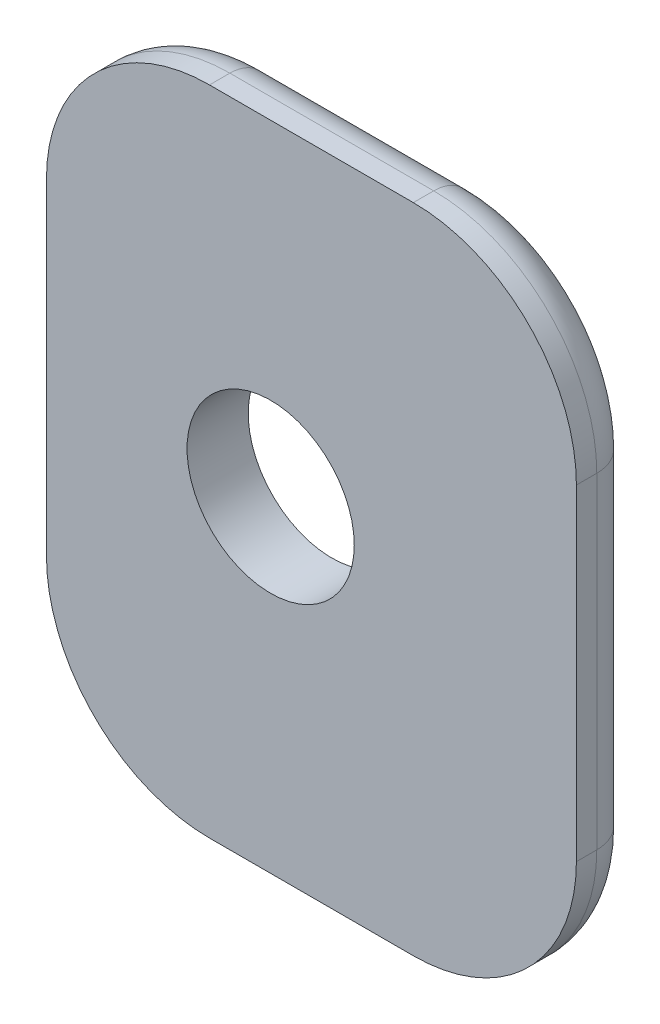
ISO-10303-21;
HEADER;
FILE_DESCRIPTION(('STEP AP214'),'2;1');
FILE_NAME('part.step','',(''),(''),'','','');
FILE_SCHEMA(('AUTOMOTIVE_DESIGN { 1 0 10303 214 1 1 1 1 }'));
ENDSEC;
DATA;
#1=APPLICATION_CONTEXT('core data for automotive mechanical design processes');
#2=APPLICATION_PROTOCOL_DEFINITION('international standard','automotive_design',2000,#1);
#3=PRODUCT_CONTEXT('',#1,'mechanical');
#4=PRODUCT('Part','Part','',(#3));
#5=PRODUCT_RELATED_PRODUCT_CATEGORY('part','',(#4));
#6=PRODUCT_DEFINITION_FORMATION('','',#4);
#7=PRODUCT_DEFINITION_CONTEXT('part definition',#1,'design');
#8=PRODUCT_DEFINITION('design','',#6,#7);
#9=PRODUCT_DEFINITION_SHAPE('','',#8);
#10=(LENGTH_UNIT() NAMED_UNIT(*) SI_UNIT(.MILLI.,.METRE.));
#11=(NAMED_UNIT(*) PLANE_ANGLE_UNIT() SI_UNIT($,.RADIAN.));
#12=(NAMED_UNIT(*) SI_UNIT($,.STERADIAN.) SOLID_ANGLE_UNIT());
#13=UNCERTAINTY_MEASURE_WITH_UNIT(LENGTH_MEASURE(1.E-05),#10,'distance_accuracy_value','');
#14=(GEOMETRIC_REPRESENTATION_CONTEXT(3) GLOBAL_UNCERTAINTY_ASSIGNED_CONTEXT((#13)) GLOBAL_UNIT_ASSIGNED_CONTEXT((#10,
#11,#12)) REPRESENTATION_CONTEXT('',''));
#15=CARTESIAN_POINT('',(0.,0.,0.));
#16=DIRECTION('',(0.,0.,1.));
#17=DIRECTION('',(1.,0.,0.));
#18=AXIS2_PLACEMENT_3D('',#15,#16,#17);
#19=CARTESIAN_POINT('',(15.,-16.,3.));
#20=DIRECTION('',(0.,0.,1.));
#21=DIRECTION('',(1.,0.,0.));
#22=AXIS2_PLACEMENT_3D('',#19,#20,#21);
#23=PLANE('',#22);
#24=DIRECTION('',(1.,0.,0.));
#25=VECTOR('',#24,1.);
#26=CARTESIAN_POINT('',(-11.,-16.,3.));
#27=LINE('',#26,#25);
#28=CARTESIAN_POINT('',(-3.,-16.,3.));
#29=VERTEX_POINT('',#28);
#30=CARTESIAN_POINT('',(6.99999999999999,-16.,3.));
#31=VERTEX_POINT('',#30);
#32=EDGE_CURVE('E129',#29,#31,#27,.T.);
#33=ORIENTED_EDGE('',*,*,#32,.T.);
#34=CARTESIAN_POINT('',(7.,-8.,3.));
#35=DIRECTION('',(0.,0.,1.));
#36=DIRECTION('',(1.,0.,0.));
#37=AXIS2_PLACEMENT_3D('',#34,#35,#36);
#38=CIRCLE('',#37,8.);
#39=CARTESIAN_POINT('',(15.,-8.,3.));
#40=VERTEX_POINT('',#39);
#41=EDGE_CURVE('E123',#31,#40,#38,.T.);
#42=ORIENTED_EDGE('',*,*,#41,.T.);
#43=DIRECTION('',(0.,1.,0.));
#44=VECTOR('',#43,1.);
#45=CARTESIAN_POINT('',(15.,16.,3.));
#46=LINE('',#45,#44);
#47=CARTESIAN_POINT('',(15.,8.00000000000001,3.));
#48=VERTEX_POINT('',#47);
#49=EDGE_CURVE('E126',#40,#48,#46,.T.);
#50=ORIENTED_EDGE('',*,*,#49,.T.);
#51=CARTESIAN_POINT('',(7.,8.00000000000001,3.));
#52=DIRECTION('',(0.,0.,1.));
#53=DIRECTION('',(1.,0.,0.));
#54=AXIS2_PLACEMENT_3D('',#51,#52,#53);
#55=CIRCLE('',#54,8.);
#56=CARTESIAN_POINT('',(6.99999999999999,16.,3.));
#57=VERTEX_POINT('',#56);
#58=EDGE_CURVE('E159',#48,#57,#55,.T.);
#59=ORIENTED_EDGE('',*,*,#58,.T.);
#60=DIRECTION('',(-1.,0.,0.));
#61=VECTOR('',#60,1.);
#62=CARTESIAN_POINT('',(-11.,16.,3.));
#63=LINE('',#62,#61);
#64=CARTESIAN_POINT('',(-3.00000000000001,16.,3.));
#65=VERTEX_POINT('',#64);
#66=EDGE_CURVE('E143',#57,#65,#63,.T.);
#67=ORIENTED_EDGE('',*,*,#66,.T.);
#68=CARTESIAN_POINT('',(-3.,8.,3.));
#69=DIRECTION('',(0.,0.,1.));
#70=DIRECTION('',(1.,0.,0.));
#71=AXIS2_PLACEMENT_3D('',#68,#69,#70);
#72=CIRCLE('',#71,8.);
#73=CARTESIAN_POINT('',(-11.,8.,3.));
#74=VERTEX_POINT('',#73);
#75=EDGE_CURVE('E157',#65,#74,#72,.T.);
#76=ORIENTED_EDGE('',*,*,#75,.T.);
#77=DIRECTION('',(0.,-1.,0.));
#78=VECTOR('',#77,1.);
#79=CARTESIAN_POINT('',(-11.,16.,3.));
#80=LINE('',#79,#78);
#81=CARTESIAN_POINT('',(-11.,-8.,3.));
#82=VERTEX_POINT('',#81);
#83=EDGE_CURVE('E235',#74,#82,#80,.T.);
#84=ORIENTED_EDGE('',*,*,#83,.T.);
#85=CARTESIAN_POINT('',(-3.,-8.,3.));
#86=DIRECTION('',(0.,0.,1.));
#87=DIRECTION('',(1.,0.,0.));
#88=AXIS2_PLACEMENT_3D('',#85,#86,#87);
#89=CIRCLE('',#88,8.);
#90=EDGE_CURVE('E134',#82,#29,#89,.T.);
#91=ORIENTED_EDGE('',*,*,#90,.T.);
#92=EDGE_LOOP('',(#33,#42,#50,#59,#67,#76,#84,#91));
#93=FACE_BOUND('',#92,.T.);
#94=CARTESIAN_POINT('',(0.,0.,3.));
#95=DIRECTION('',(0.,0.,1.));
#96=DIRECTION('',(1.,0.,0.));
#97=AXIS2_PLACEMENT_3D('',#94,#95,#96);
#98=CIRCLE('',#97,4.1021);
#99=CARTESIAN_POINT('',(4.1021,0.,3.));
#100=VERTEX_POINT('',#99);
#101=EDGE_CURVE('E144',#100,#100,#98,.T.);
#102=ORIENTED_EDGE('',*,*,#101,.F.);
#103=EDGE_LOOP('',(#102));
#104=FACE_BOUND('',#103,.T.);
#105=ADVANCED_FACE('F32',(#93,#104),#23,.T.);
#106=CARTESIAN_POINT('',(15.,-16.,0.));
#107=DIRECTION('',(0.,0.,1.));
#108=DIRECTION('',(1.,0.,0.));
#109=AXIS2_PLACEMENT_3D('',#106,#107,#108);
#110=PLANE('',#109);
#111=DIRECTION('',(0.,-1.,0.));
#112=VECTOR('',#111,1.);
#113=CARTESIAN_POINT('',(-9.,-16.,0.));
#114=LINE('',#113,#112);
#115=CARTESIAN_POINT('',(-9.,-8.,0.));
#116=VERTEX_POINT('',#115);
#117=CARTESIAN_POINT('',(-9.,8.,0.));
#118=VERTEX_POINT('',#117);
#119=EDGE_CURVE('E170',#116,#118,#114,.F.);
#120=ORIENTED_EDGE('',*,*,#119,.T.);
#121=CARTESIAN_POINT('',(-3.,8.,0.));
#122=DIRECTION('',(0.,0.,1.));
#123=DIRECTION('',(1.,0.,0.));
#124=AXIS2_PLACEMENT_3D('',#121,#122,#123);
#125=CIRCLE('',#124,6.);
#126=CARTESIAN_POINT('',(-3.,14.,0.));
#127=VERTEX_POINT('',#126);
#128=EDGE_CURVE('E184',#118,#127,#125,.F.);
#129=ORIENTED_EDGE('',*,*,#128,.T.);
#130=DIRECTION('',(-1.,0.,0.));
#131=VECTOR('',#130,1.);
#132=CARTESIAN_POINT('',(15.,14.,0.));
#133=LINE('',#132,#131);
#134=CARTESIAN_POINT('',(6.99999999999999,14.,0.));
#135=VERTEX_POINT('',#134);
#136=EDGE_CURVE('E182',#127,#135,#133,.F.);
#137=ORIENTED_EDGE('',*,*,#136,.T.);
#138=CARTESIAN_POINT('',(7.,8.00000000000001,0.));
#139=DIRECTION('',(0.,0.,1.));
#140=DIRECTION('',(1.,0.,0.));
#141=AXIS2_PLACEMENT_3D('',#138,#139,#140);
#142=CIRCLE('',#141,6.);
#143=CARTESIAN_POINT('',(13.,8.00000000000001,0.));
#144=VERTEX_POINT('',#143);
#145=EDGE_CURVE('E180',#135,#144,#142,.F.);
#146=ORIENTED_EDGE('',*,*,#145,.T.);
#147=DIRECTION('',(0.,1.,0.));
#148=VECTOR('',#147,1.);
#149=CARTESIAN_POINT('',(13.,-16.,0.));
#150=LINE('',#149,#148);
#151=CARTESIAN_POINT('',(13.,-8.,0.));
#152=VERTEX_POINT('',#151);
#153=EDGE_CURVE('E178',#144,#152,#150,.F.);
#154=ORIENTED_EDGE('',*,*,#153,.T.);
#155=CARTESIAN_POINT('',(7.,-8.,0.));
#156=DIRECTION('',(0.,0.,1.));
#157=DIRECTION('',(1.,0.,0.));
#158=AXIS2_PLACEMENT_3D('',#155,#156,#157);
#159=CIRCLE('',#158,6.);
#160=CARTESIAN_POINT('',(7.,-14.,0.));
#161=VERTEX_POINT('',#160);
#162=EDGE_CURVE('E176',#152,#161,#159,.F.);
#163=ORIENTED_EDGE('',*,*,#162,.T.);
#164=DIRECTION('',(1.,0.,0.));
#165=VECTOR('',#164,1.);
#166=CARTESIAN_POINT('',(15.,-14.,0.));
#167=LINE('',#166,#165);
#168=CARTESIAN_POINT('',(-3.,-14.,0.));
#169=VERTEX_POINT('',#168);
#170=EDGE_CURVE('E174',#161,#169,#167,.F.);
#171=ORIENTED_EDGE('',*,*,#170,.T.);
#172=CARTESIAN_POINT('',(-3.,-8.,0.));
#173=DIRECTION('',(0.,0.,1.));
#174=DIRECTION('',(1.,0.,0.));
#175=AXIS2_PLACEMENT_3D('',#172,#173,#174);
#176=CIRCLE('',#175,6.);
#177=EDGE_CURVE('E172',#169,#116,#176,.F.);
#178=ORIENTED_EDGE('',*,*,#177,.T.);
#179=EDGE_LOOP('',(#120,#129,#137,#146,#154,#163,#171,#178));
#180=FACE_BOUND('',#179,.T.);
#181=CARTESIAN_POINT('',(0.,0.,0.));
#182=DIRECTION('',(0.,0.,1.));
#183=DIRECTION('',(1.,0.,0.));
#184=AXIS2_PLACEMENT_3D('',#181,#182,#183);
#185=CIRCLE('',#184,4.1021);
#186=CARTESIAN_POINT('',(4.1021,0.,0.));
#187=VERTEX_POINT('',#186);
#188=EDGE_CURVE('E221',#187,#187,#185,.T.);
#189=ORIENTED_EDGE('',*,*,#188,.T.);
#190=EDGE_LOOP('',(#189));
#191=FACE_BOUND('',#190,.T.);
#192=ADVANCED_FACE('F252',(#180,#191),#110,.F.);
#193=CARTESIAN_POINT('',(15.,16.,3.));
#194=DIRECTION('',(-1.,0.,0.));
#195=DIRECTION('',(0.,-1.,0.));
#196=AXIS2_PLACEMENT_3D('',#193,#194,#195);
#197=PLANE('',#196);
#198=DIRECTION('',(0.,0.,-1.));
#199=VECTOR('',#198,1.);
#200=CARTESIAN_POINT('',(15.,-8.,3.));
#201=LINE('',#200,#199);
#202=CARTESIAN_POINT('',(15.,-8.,2.));
#203=VERTEX_POINT('',#202);
#204=EDGE_CURVE('E139',#40,#203,#201,.T.);
#205=ORIENTED_EDGE('',*,*,#204,.T.);
#206=DIRECTION('',(0.,1.,0.));
#207=VECTOR('',#206,1.);
#208=CARTESIAN_POINT('',(15.,16.,2.));
#209=LINE('',#208,#207);
#210=CARTESIAN_POINT('',(15.,8.00000000000001,2.));
#211=VERTEX_POINT('',#210);
#212=EDGE_CURVE('E194',#203,#211,#209,.T.);
#213=ORIENTED_EDGE('',*,*,#212,.T.);
#214=DIRECTION('',(0.,0.,-1.));
#215=VECTOR('',#214,1.);
#216=CARTESIAN_POINT('',(15.,8.00000000000001,3.));
#217=LINE('',#216,#215);
#218=EDGE_CURVE('E142',#211,#48,#217,.F.);
#219=ORIENTED_EDGE('',*,*,#218,.T.);
#220=ORIENTED_EDGE('',*,*,#49,.F.);
#221=EDGE_LOOP('',(#205,#213,#219,#220));
#222=FACE_BOUND('',#221,.T.);
#223=ADVANCED_FACE('F138',(#222),#197,.F.);
#224=CARTESIAN_POINT('',(-11.,16.,3.));
#225=DIRECTION('',(0.,-1.,0.));
#226=DIRECTION('',(1.,0.,0.));
#227=AXIS2_PLACEMENT_3D('',#224,#225,#226);
#228=PLANE('',#227);
#229=DIRECTION('',(0.,0.,-1.));
#230=VECTOR('',#229,1.);
#231=CARTESIAN_POINT('',(6.99999999999999,16.,3.));
#232=LINE('',#231,#230);
#233=CARTESIAN_POINT('',(6.99999999999999,16.,2.));
#234=VERTEX_POINT('',#233);
#235=EDGE_CURVE('E167',#57,#234,#232,.T.);
#236=ORIENTED_EDGE('',*,*,#235,.T.);
#237=DIRECTION('',(-1.,0.,0.));
#238=VECTOR('',#237,1.);
#239=CARTESIAN_POINT('',(-11.,16.,2.));
#240=LINE('',#239,#238);
#241=CARTESIAN_POINT('',(-3.,16.,2.));
#242=VERTEX_POINT('',#241);
#243=EDGE_CURVE('E190',#234,#242,#240,.T.);
#244=ORIENTED_EDGE('',*,*,#243,.T.);
#245=DIRECTION('',(0.,0.,-1.));
#246=VECTOR('',#245,1.);
#247=CARTESIAN_POINT('',(-3.,16.,3.));
#248=LINE('',#247,#246);
#249=EDGE_CURVE('E165',#242,#65,#248,.F.);
#250=ORIENTED_EDGE('',*,*,#249,.T.);
#251=ORIENTED_EDGE('',*,*,#66,.F.);
#252=EDGE_LOOP('',(#236,#244,#250,#251));
#253=FACE_BOUND('',#252,.T.);
#254=ADVANCED_FACE('F264',(#253),#228,.F.);
#255=CARTESIAN_POINT('',(-11.,16.,3.));
#256=DIRECTION('',(1.,0.,0.));
#257=DIRECTION('',(0.,1.,0.));
#258=AXIS2_PLACEMENT_3D('',#255,#256,#257);
#259=PLANE('',#258);
#260=DIRECTION('',(0.,0.,-1.));
#261=VECTOR('',#260,1.);
#262=CARTESIAN_POINT('',(-11.,8.,3.));
#263=LINE('',#262,#261);
#264=CARTESIAN_POINT('',(-11.,8.,2.));
#265=VERTEX_POINT('',#264);
#266=EDGE_CURVE('E133',#74,#265,#263,.T.);
#267=ORIENTED_EDGE('',*,*,#266,.T.);
#268=DIRECTION('',(0.,-1.,0.));
#269=VECTOR('',#268,1.);
#270=CARTESIAN_POINT('',(-11.,16.,2.));
#271=LINE('',#270,#269);
#272=CARTESIAN_POINT('',(-11.,-8.,2.));
#273=VERTEX_POINT('',#272);
#274=EDGE_CURVE('E11',#265,#273,#271,.T.);
#275=ORIENTED_EDGE('',*,*,#274,.T.);
#276=DIRECTION('',(0.,0.,-1.));
#277=VECTOR('',#276,1.);
#278=CARTESIAN_POINT('',(-11.,-8.,3.));
#279=LINE('',#278,#277);
#280=EDGE_CURVE('E163',#273,#82,#279,.F.);
#281=ORIENTED_EDGE('',*,*,#280,.T.);
#282=ORIENTED_EDGE('',*,*,#83,.F.);
#283=EDGE_LOOP('',(#267,#275,#281,#282));
#284=FACE_BOUND('',#283,.T.);
#285=ADVANCED_FACE('F302',(#284),#259,.F.);
#286=CARTESIAN_POINT('',(-11.,-16.,3.));
#287=DIRECTION('',(0.,1.,0.));
#288=DIRECTION('',(0.,0.,1.));
#289=AXIS2_PLACEMENT_3D('',#286,#287,#288);
#290=PLANE('',#289);
#291=DIRECTION('',(0.,0.,-1.));
#292=VECTOR('',#291,1.);
#293=CARTESIAN_POINT('',(-3.,-16.,3.));
#294=LINE('',#293,#292);
#295=CARTESIAN_POINT('',(-3.,-16.,2.));
#296=VERTEX_POINT('',#295);
#297=EDGE_CURVE('E149',#29,#296,#294,.T.);
#298=ORIENTED_EDGE('',*,*,#297,.T.);
#299=DIRECTION('',(1.,0.,0.));
#300=VECTOR('',#299,1.);
#301=CARTESIAN_POINT('',(-11.,-16.,2.));
#302=LINE('',#301,#300);
#303=CARTESIAN_POINT('',(7.,-16.,2.));
#304=VERTEX_POINT('',#303);
#305=EDGE_CURVE('E197',#296,#304,#302,.T.);
#306=ORIENTED_EDGE('',*,*,#305,.T.);
#307=DIRECTION('',(0.,0.,-1.));
#308=VECTOR('',#307,1.);
#309=CARTESIAN_POINT('',(7.,-16.,3.));
#310=LINE('',#309,#308);
#311=EDGE_CURVE('E151',#304,#31,#310,.F.);
#312=ORIENTED_EDGE('',*,*,#311,.T.);
#313=ORIENTED_EDGE('',*,*,#32,.F.);
#314=EDGE_LOOP('',(#298,#306,#312,#313));
#315=FACE_BOUND('',#314,.T.);
#316=ADVANCED_FACE('F243',(#315),#290,.F.);
#317=CARTESIAN_POINT('',(0.,0.,3.));
#318=DIRECTION('',(0.,0.,-1.));
#319=DIRECTION('',(-1.,0.,0.));
#320=AXIS2_PLACEMENT_3D('',#317,#318,#319);
#321=CYLINDRICAL_SURFACE('',#320,4.1021);
#322=ORIENTED_EDGE('',*,*,#101,.T.);
#323=EDGE_LOOP('',(#322));
#324=FACE_BOUND('',#323,.T.);
#325=ORIENTED_EDGE('',*,*,#188,.F.);
#326=EDGE_LOOP('',(#325));
#327=FACE_BOUND('',#326,.T.);
#328=ADVANCED_FACE('F298',(#324,#327),#321,.F.);
#329=CARTESIAN_POINT('',(7.,-8.,3.));
#330=DIRECTION('',(0.,0.,-1.));
#331=DIRECTION('',(-1.,0.,0.));
#332=AXIS2_PLACEMENT_3D('',#329,#330,#331);
#333=CYLINDRICAL_SURFACE('',#332,8.);
#334=ORIENTED_EDGE('',*,*,#311,.F.);
#335=CARTESIAN_POINT('',(7.,-8.,2.));
#336=DIRECTION('',(0.,0.,1.));
#337=DIRECTION('',(1.,0.,0.));
#338=AXIS2_PLACEMENT_3D('',#335,#336,#337);
#339=CIRCLE('',#338,8.);
#340=EDGE_CURVE('E148',#304,#203,#339,.T.);
#341=ORIENTED_EDGE('',*,*,#340,.T.);
#342=ORIENTED_EDGE('',*,*,#204,.F.);
#343=ORIENTED_EDGE('',*,*,#41,.F.);
#344=EDGE_LOOP('',(#334,#341,#342,#343));
#345=FACE_BOUND('',#344,.T.);
#346=ADVANCED_FACE('F146',(#345),#333,.T.);
#347=CARTESIAN_POINT('',(-3.,-8.,3.));
#348=DIRECTION('',(0.,0.,-1.));
#349=DIRECTION('',(-1.,0.,0.));
#350=AXIS2_PLACEMENT_3D('',#347,#348,#349);
#351=CYLINDRICAL_SURFACE('',#350,8.);
#352=ORIENTED_EDGE('',*,*,#280,.F.);
#353=CARTESIAN_POINT('',(-3.,-8.,2.));
#354=DIRECTION('',(0.,0.,1.));
#355=DIRECTION('',(1.,0.,0.));
#356=AXIS2_PLACEMENT_3D('',#353,#354,#355);
#357=CIRCLE('',#356,8.);
#358=EDGE_CURVE('E41',#273,#296,#357,.T.);
#359=ORIENTED_EDGE('',*,*,#358,.T.);
#360=ORIENTED_EDGE('',*,*,#297,.F.);
#361=ORIENTED_EDGE('',*,*,#90,.F.);
#362=EDGE_LOOP('',(#352,#359,#360,#361));
#363=FACE_BOUND('',#362,.T.);
#364=ADVANCED_FACE('F241',(#363),#351,.T.);
#365=CARTESIAN_POINT('',(7.,8.00000000000001,3.));
#366=DIRECTION('',(0.,0.,-1.));
#367=DIRECTION('',(-1.,0.,0.));
#368=AXIS2_PLACEMENT_3D('',#365,#366,#367);
#369=CYLINDRICAL_SURFACE('',#368,8.);
#370=ORIENTED_EDGE('',*,*,#218,.F.);
#371=CARTESIAN_POINT('',(7.,8.00000000000001,2.));
#372=DIRECTION('',(0.,0.,1.));
#373=DIRECTION('',(1.,0.,0.));
#374=AXIS2_PLACEMENT_3D('',#371,#372,#373);
#375=CIRCLE('',#374,8.);
#376=EDGE_CURVE('E192',#211,#234,#375,.T.);
#377=ORIENTED_EDGE('',*,*,#376,.T.);
#378=ORIENTED_EDGE('',*,*,#235,.F.);
#379=ORIENTED_EDGE('',*,*,#58,.F.);
#380=EDGE_LOOP('',(#370,#377,#378,#379));
#381=FACE_BOUND('',#380,.T.);
#382=ADVANCED_FACE('F260',(#381),#369,.T.);
#383=CARTESIAN_POINT('',(-3.,8.,3.));
#384=DIRECTION('',(0.,0.,-1.));
#385=DIRECTION('',(-1.,0.,0.));
#386=AXIS2_PLACEMENT_3D('',#383,#384,#385);
#387=CYLINDRICAL_SURFACE('',#386,8.);
#388=ORIENTED_EDGE('',*,*,#249,.F.);
#389=CARTESIAN_POINT('',(-3.,8.,2.));
#390=DIRECTION('',(0.,0.,1.));
#391=DIRECTION('',(1.,0.,0.));
#392=AXIS2_PLACEMENT_3D('',#389,#390,#391);
#393=CIRCLE('',#392,8.);
#394=EDGE_CURVE('E187',#242,#265,#393,.T.);
#395=ORIENTED_EDGE('',*,*,#394,.T.);
#396=ORIENTED_EDGE('',*,*,#266,.F.);
#397=ORIENTED_EDGE('',*,*,#75,.F.);
#398=EDGE_LOOP('',(#388,#395,#396,#397));
#399=FACE_BOUND('',#398,.T.);
#400=ADVANCED_FACE('F270',(#399),#387,.T.);
#401=CARTESIAN_POINT('',(7.,-8.,2.));
#402=DIRECTION('',(0.,0.,1.));
#403=DIRECTION('',(1.,0.,0.));
#404=AXIS2_PLACEMENT_3D('',#401,#402,#403);
#405=TOROIDAL_SURFACE('',#404,6.,2.);
#406=CARTESIAN_POINT('',(13.,-8.,2.));
#407=DIRECTION('',(0.,1.,0.));
#408=DIRECTION('',(0.,0.,1.));
#409=AXIS2_PLACEMENT_3D('',#406,#407,#408);
#410=CIRCLE('',#409,2.);
#411=EDGE_CURVE('E215',#203,#152,#410,.T.);
#412=ORIENTED_EDGE('',*,*,#411,.F.);
#413=ORIENTED_EDGE('',*,*,#340,.F.);
#414=CARTESIAN_POINT('',(7.,-14.,2.));
#415=DIRECTION('',(-1.,0.,0.));
#416=DIRECTION('',(0.,0.,1.));
#417=AXIS2_PLACEMENT_3D('',#414,#415,#416);
#418=CIRCLE('',#417,2.);
#419=EDGE_CURVE('E36',#161,#304,#418,.T.);
#420=ORIENTED_EDGE('',*,*,#419,.F.);
#421=ORIENTED_EDGE('',*,*,#162,.F.);
#422=EDGE_LOOP('',(#412,#413,#420,#421));
#423=FACE_BOUND('',#422,.T.);
#424=ADVANCED_FACE('F34',(#423),#405,.T.);
#425=CARTESIAN_POINT('',(-11.,-14.,2.));
#426=DIRECTION('',(1.,0.,0.));
#427=DIRECTION('',(0.,0.,-1.));
#428=AXIS2_PLACEMENT_3D('',#425,#426,#427);
#429=CYLINDRICAL_SURFACE('',#428,2.);
#430=ORIENTED_EDGE('',*,*,#419,.T.);
#431=ORIENTED_EDGE('',*,*,#305,.F.);
#432=CARTESIAN_POINT('',(-3.,-14.,2.));
#433=DIRECTION('',(-1.,0.,0.));
#434=DIRECTION('',(0.,0.,1.));
#435=AXIS2_PLACEMENT_3D('',#432,#433,#434);
#436=CIRCLE('',#435,2.);
#437=EDGE_CURVE('E213',#169,#296,#436,.T.);
#438=ORIENTED_EDGE('',*,*,#437,.F.);
#439=ORIENTED_EDGE('',*,*,#170,.F.);
#440=EDGE_LOOP('',(#430,#431,#438,#439));
#441=FACE_BOUND('',#440,.T.);
#442=ADVANCED_FACE('F245',(#441),#429,.T.);
#443=CARTESIAN_POINT('',(13.,16.,2.));
#444=DIRECTION('',(0.,1.,0.));
#445=DIRECTION('',(-1.,0.,0.));
#446=AXIS2_PLACEMENT_3D('',#443,#444,#445);
#447=CYLINDRICAL_SURFACE('',#446,2.);
#448=ORIENTED_EDGE('',*,*,#411,.T.);
#449=ORIENTED_EDGE('',*,*,#153,.F.);
#450=CARTESIAN_POINT('',(13.,8.00000000000001,2.));
#451=DIRECTION('',(0.,1.,0.));
#452=DIRECTION('',(0.,0.,1.));
#453=AXIS2_PLACEMENT_3D('',#450,#451,#452);
#454=CIRCLE('',#453,2.);
#455=EDGE_CURVE('E210',#211,#144,#454,.T.);
#456=ORIENTED_EDGE('',*,*,#455,.F.);
#457=ORIENTED_EDGE('',*,*,#212,.F.);
#458=EDGE_LOOP('',(#448,#449,#456,#457));
#459=FACE_BOUND('',#458,.T.);
#460=ADVANCED_FACE('F257',(#459),#447,.T.);
#461=CARTESIAN_POINT('',(-3.,-8.,2.));
#462=DIRECTION('',(0.,0.,1.));
#463=DIRECTION('',(1.,0.,0.));
#464=AXIS2_PLACEMENT_3D('',#461,#462,#463);
#465=TOROIDAL_SURFACE('',#464,6.,2.);
#466=ORIENTED_EDGE('',*,*,#437,.T.);
#467=ORIENTED_EDGE('',*,*,#358,.F.);
#468=CARTESIAN_POINT('',(-9.,-8.,2.));
#469=DIRECTION('',(0.,1.,0.));
#470=DIRECTION('',(0.,0.,1.));
#471=AXIS2_PLACEMENT_3D('',#468,#469,#470);
#472=CIRCLE('',#471,2.);
#473=EDGE_CURVE('E207',#116,#273,#472,.T.);
#474=ORIENTED_EDGE('',*,*,#473,.F.);
#475=ORIENTED_EDGE('',*,*,#177,.F.);
#476=EDGE_LOOP('',(#466,#467,#474,#475));
#477=FACE_BOUND('',#476,.T.);
#478=ADVANCED_FACE('F248',(#477),#465,.T.);
#479=CARTESIAN_POINT('',(7.,8.00000000000001,2.));
#480=DIRECTION('',(0.,0.,1.));
#481=DIRECTION('',(1.,0.,0.));
#482=AXIS2_PLACEMENT_3D('',#479,#480,#481);
#483=TOROIDAL_SURFACE('',#482,6.,2.);
#484=ORIENTED_EDGE('',*,*,#455,.T.);
#485=ORIENTED_EDGE('',*,*,#145,.F.);
#486=CARTESIAN_POINT('',(6.99999999999999,14.,2.));
#487=DIRECTION('',(-1.,0.,0.));
#488=DIRECTION('',(0.,-1.,0.));
#489=AXIS2_PLACEMENT_3D('',#486,#487,#488);
#490=CIRCLE('',#489,2.);
#491=EDGE_CURVE('E204',#234,#135,#490,.T.);
#492=ORIENTED_EDGE('',*,*,#491,.F.);
#493=ORIENTED_EDGE('',*,*,#376,.F.);
#494=EDGE_LOOP('',(#484,#485,#492,#493));
#495=FACE_BOUND('',#494,.T.);
#496=ADVANCED_FACE('F280',(#495),#483,.T.);
#497=CARTESIAN_POINT('',(-9.,16.,2.));
#498=DIRECTION('',(0.,-1.,0.));
#499=DIRECTION('',(1.,0.,0.));
#500=AXIS2_PLACEMENT_3D('',#497,#498,#499);
#501=CYLINDRICAL_SURFACE('',#500,2.);
#502=ORIENTED_EDGE('',*,*,#473,.T.);
#503=ORIENTED_EDGE('',*,*,#274,.F.);
#504=CARTESIAN_POINT('',(-9.,8.,2.));
#505=DIRECTION('',(0.,1.,0.));
#506=DIRECTION('',(0.,0.,1.));
#507=AXIS2_PLACEMENT_3D('',#504,#505,#506);
#508=CIRCLE('',#507,2.);
#509=EDGE_CURVE('E202',#118,#265,#508,.T.);
#510=ORIENTED_EDGE('',*,*,#509,.F.);
#511=ORIENTED_EDGE('',*,*,#119,.F.);
#512=EDGE_LOOP('',(#502,#503,#510,#511));
#513=FACE_BOUND('',#512,.T.);
#514=ADVANCED_FACE('F282',(#513),#501,.T.);
#515=CARTESIAN_POINT('',(-11.,14.,2.));
#516=DIRECTION('',(-1.,0.,0.));
#517=DIRECTION('',(0.,-1.,0.));
#518=AXIS2_PLACEMENT_3D('',#515,#516,#517);
#519=CYLINDRICAL_SURFACE('',#518,2.);
#520=ORIENTED_EDGE('',*,*,#491,.T.);
#521=ORIENTED_EDGE('',*,*,#136,.F.);
#522=CARTESIAN_POINT('',(-3.,14.,2.));
#523=DIRECTION('',(-1.,0.,0.));
#524=DIRECTION('',(0.,-1.,0.));
#525=AXIS2_PLACEMENT_3D('',#522,#523,#524);
#526=CIRCLE('',#525,2.);
#527=EDGE_CURVE('E200',#242,#127,#526,.T.);
#528=ORIENTED_EDGE('',*,*,#527,.F.);
#529=ORIENTED_EDGE('',*,*,#243,.F.);
#530=EDGE_LOOP('',(#520,#521,#528,#529));
#531=FACE_BOUND('',#530,.T.);
#532=ADVANCED_FACE('F277',(#531),#519,.T.);
#533=CARTESIAN_POINT('',(-3.,8.,2.));
#534=DIRECTION('',(0.,0.,1.));
#535=DIRECTION('',(1.,0.,0.));
#536=AXIS2_PLACEMENT_3D('',#533,#534,#535);
#537=TOROIDAL_SURFACE('',#536,6.,2.);
#538=ORIENTED_EDGE('',*,*,#509,.T.);
#539=ORIENTED_EDGE('',*,*,#394,.F.);
#540=ORIENTED_EDGE('',*,*,#527,.T.);
#541=ORIENTED_EDGE('',*,*,#128,.F.);
#542=EDGE_LOOP('',(#538,#539,#540,#541));
#543=FACE_BOUND('',#542,.T.);
#544=ADVANCED_FACE('F273',(#543),#537,.T.);
#545=CLOSED_SHELL('',(#105,#192,#223,#254,#285,#316,#328,#346,#364,#382,#400,#424,#442,#460,
#478,#496,#514,#532,#544));
#546=MANIFOLD_SOLID_BREP('B2',#545);
#547=ADVANCED_BREP_SHAPE_REPRESENTATION('',(#18,#546),#14);
#548=SHAPE_DEFINITION_REPRESENTATION(#9,#547);
ENDSEC;
END-ISO-10303-21;
